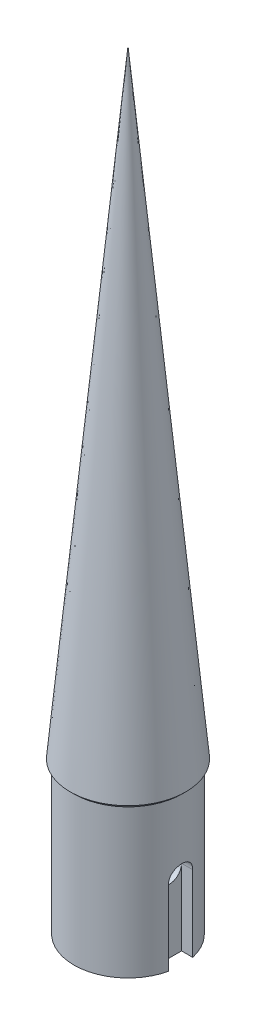
ISO-10303-21;
HEADER;
FILE_DESCRIPTION(('STEP AP214'),'2;1');
FILE_NAME('part.step','',(''),(''),'','','');
FILE_SCHEMA(('AUTOMOTIVE_DESIGN { 1 0 10303 214 1 1 1 1 }'));
ENDSEC;
DATA;
#1=APPLICATION_CONTEXT('core data for automotive mechanical design processes');
#2=APPLICATION_PROTOCOL_DEFINITION('international standard','automotive_design',2000,#1);
#3=PRODUCT_CONTEXT('',#1,'mechanical');
#4=PRODUCT('Part','Part','',(#3));
#5=PRODUCT_RELATED_PRODUCT_CATEGORY('part','',(#4));
#6=PRODUCT_DEFINITION_FORMATION('','',#4);
#7=PRODUCT_DEFINITION_CONTEXT('part definition',#1,'design');
#8=PRODUCT_DEFINITION('design','',#6,#7);
#9=PRODUCT_DEFINITION_SHAPE('','',#8);
#10=(LENGTH_UNIT() NAMED_UNIT(*) SI_UNIT(.MILLI.,.METRE.));
#11=(NAMED_UNIT(*) PLANE_ANGLE_UNIT() SI_UNIT($,.RADIAN.));
#12=(NAMED_UNIT(*) SI_UNIT($,.STERADIAN.) SOLID_ANGLE_UNIT());
#13=UNCERTAINTY_MEASURE_WITH_UNIT(LENGTH_MEASURE(1.E-05),#10,'distance_accuracy_value','');
#14=(GEOMETRIC_REPRESENTATION_CONTEXT(3) GLOBAL_UNCERTAINTY_ASSIGNED_CONTEXT((#13)) GLOBAL_UNIT_ASSIGNED_CONTEXT((#10,
#11,#12)) REPRESENTATION_CONTEXT('',''));
#15=CARTESIAN_POINT('',(0.,0.,0.));
#16=DIRECTION('',(0.,0.,1.));
#17=DIRECTION('',(1.,0.,0.));
#18=AXIS2_PLACEMENT_3D('',#15,#16,#17);
#19=CARTESIAN_POINT('',(0.,-25.,0.));
#20=DIRECTION('',(0.,1.,0.));
#21=DIRECTION('',(0.,0.,1.));
#22=AXIS2_PLACEMENT_3D('',#19,#20,#21);
#23=CYLINDRICAL_SURFACE('',#22,8.895);
#24=CARTESIAN_POINT('',(0.,-0.599999999999993,0.));
#25=DIRECTION('',(0.,1.,0.));
#26=DIRECTION('',(0.,0.,1.));
#27=AXIS2_PLACEMENT_3D('',#24,#25,#26);
#28=CIRCLE('',#27,8.895);
#29=CARTESIAN_POINT('',(0.,-0.599999999999993,8.895));
#30=VERTEX_POINT('',#29);
#31=EDGE_CURVE('E11',#30,#30,#28,.F.);
#32=ORIENTED_EDGE('',*,*,#31,.T.);
#33=EDGE_LOOP('',(#32));
#34=FACE_BOUND('',#33,.T.);
#35=DIRECTION('',(0.,-1.,0.));
#36=VECTOR('',#35,1.);
#37=CARTESIAN_POINT('',(-8.67082930632215,-12.5,-1.98437499999999));
#38=LINE('',#37,#36);
#39=CARTESIAN_POINT('',(-8.67082930632215,-12.5,-1.984375));
#40=VERTEX_POINT('',#39);
#41=CARTESIAN_POINT('',(-8.67082930632215,-25.,-1.98437499999999));
#42=VERTEX_POINT('',#41);
#43=EDGE_CURVE('E183',#40,#42,#38,.T.);
#44=ORIENTED_EDGE('',*,*,#43,.F.);
#45=CARTESIAN_POINT('',(-8.895,-10.515625,0.));
#46=CARTESIAN_POINT('',(-8.89499798053136,-10.5156286782961,-0.110003108531044));
#47=CARTESIAN_POINT('',(-8.89293872905295,-10.5248028437771,-0.220050190385659));
#48=CARTESIAN_POINT('',(-8.88492294410009,-10.5612168017032,-0.437014773196951));
#49=CARTESIAN_POINT('',(-8.87896370197709,-10.5884691501126,-0.543930045069365));
#50=CARTESIAN_POINT('',(-8.86381097564101,-10.66014046251,-0.751464389222808));
#51=CARTESIAN_POINT('',(-8.85462093856362,-10.7045411348459,-0.852090038043748));
#52=CARTESIAN_POINT('',(-8.83399673910637,-10.809189812261,-1.04446068714721));
#53=CARTESIAN_POINT('',(-8.82256261666939,-10.8694375352822,-1.13620584545178));
#54=CARTESIAN_POINT('',(-8.79848845487047,-11.0051316026497,-1.30974205494041));
#55=CARTESIAN_POINT('',(-8.78583296110134,-11.0807914141361,-1.39136405863448));
#56=CARTESIAN_POINT('',(-8.76085045969245,-11.2447038420026,-1.54087074401027));
#57=CARTESIAN_POINT('',(-8.74852348238285,-11.332957616368,-1.60875416107165));
#58=CARTESIAN_POINT('',(-8.72544092397066,-11.520810939859,-1.72960902031442));
#59=CARTESIAN_POINT('',(-8.71470512331446,-11.6205296910602,-1.78239929438126));
#60=CARTESIAN_POINT('',(-8.69624278881732,-11.8277023668504,-1.87040686218199));
#61=CARTESIAN_POINT('',(-8.68851587956583,-11.9351553244818,-1.90562634832583));
#62=CARTESIAN_POINT('',(-8.67710379688232,-12.1529089981679,-1.95693151039241));
#63=CARTESIAN_POINT('',(-8.67335534128796,-12.2631356576469,-1.9733171227466));
#64=CARTESIAN_POINT('',(-8.67013460913494,-12.4848322544565,-1.98742225140913));
#65=CARTESIAN_POINT('',(-8.67066178498573,-12.5963020307519,-1.98514415802333));
#66=CARTESIAN_POINT('',(-8.6758755128654,-12.8150819521088,-1.96222763913715));
#67=CARTESIAN_POINT('',(-8.68048286491296,-12.9224308899092,-1.94193880078754));
#68=CARTESIAN_POINT('',(-8.69321246305035,-13.1321618701326,-1.88413107223078));
#69=CARTESIAN_POINT('',(-8.70133491344556,-13.2345436234669,-1.84661118050843));
#70=CARTESIAN_POINT('',(-8.72025684575896,-13.4324107413625,-1.75508849250558));
#71=CARTESIAN_POINT('',(-8.73107785800529,-13.5278322502844,-1.70095228060515));
#72=CARTESIAN_POINT('',(-8.75416459631689,-13.7083654708171,-1.57782741855743));
#73=CARTESIAN_POINT('',(-8.76643052669428,-13.7934757209513,-1.50883666682662));
#74=CARTESIAN_POINT('',(-8.79136402902234,-13.9529819654673,-1.35611581093398));
#75=CARTESIAN_POINT('',(-8.8040344247618,-14.0270934621295,-1.27208872607875));
#76=CARTESIAN_POINT('',(-8.82809796612522,-14.1602203300518,-1.09265382918496));
#77=CARTESIAN_POINT('',(-8.83949108676558,-14.2192354060537,-0.99724579460952));
#78=CARTESIAN_POINT('',(-8.85975573704167,-14.3205689320845,-0.797402322384055));
#79=CARTESIAN_POINT('',(-8.86862144653922,-14.3628489299928,-0.692946759215006));
#80=CARTESIAN_POINT('',(-8.88278925247284,-14.4291766978656,-0.478171595830713));
#81=CARTESIAN_POINT('',(-8.88809188846723,-14.4532272283998,-0.367852886206666));
#82=CARTESIAN_POINT('',(-8.89445888054048,-14.4819968395156,-0.146922244637292));
#83=CARTESIAN_POINT('',(-8.89560839126927,-14.487104381303,-0.0363632839080309));
#84=CARTESIAN_POINT('',(-8.89377875578923,-14.4788975892449,0.184028216567811));
#85=CARTESIAN_POINT('',(-8.8907999015053,-14.4655845579548,0.293860807125686));
#86=CARTESIAN_POINT('',(-8.88110209755264,-14.4212364374193,0.508386435136476));
#87=CARTESIAN_POINT('',(-8.87442639805636,-14.3904061793644,0.613123945630332));
#88=CARTESIAN_POINT('',(-8.85808259752387,-14.3121269856043,0.815940337496674));
#89=CARTESIAN_POINT('',(-8.84841423460527,-14.2646765954544,0.914018635217614));
#90=CARTESIAN_POINT('',(-8.82694819211914,-14.1537022358176,1.10233086452755));
#91=CARTESIAN_POINT('',(-8.81512120261388,-14.0899514567944,1.1924277186746));
#92=CARTESIAN_POINT('',(-8.79070766484064,-13.9484834474263,1.36078396392382));
#93=CARTESIAN_POINT('',(-8.77812101382286,-13.8707643249358,1.43904174866253));
#94=CARTESIAN_POINT('',(-8.75331093693519,-13.7017800928848,1.58304298834678));
#95=CARTESIAN_POINT('',(-8.74109914583823,-13.6102832900571,1.64851693602485));
#96=CARTESIAN_POINT('',(-8.71869698047453,-13.4173649355546,1.76317168339184));
#97=CARTESIAN_POINT('',(-8.70850651768816,-13.315943818784,1.81235319663538));
#98=CARTESIAN_POINT('',(-8.69140054463049,-13.1066041991113,1.89268852324433));
#99=CARTESIAN_POINT('',(-8.68446640876592,-12.9987267288714,1.92394509722755));
#100=CARTESIAN_POINT('',(-8.67462629679212,-12.7790753551192,1.96784118701104));
#101=CARTESIAN_POINT('',(-8.67171964652347,-12.6673021069317,1.98048381861487));
#102=CARTESIAN_POINT('',(-8.67030729710035,-12.4457524437848,1.9866564116767));
#103=CARTESIAN_POINT('',(-8.67170310734381,-12.3359883589578,1.98061409297813));
#104=CARTESIAN_POINT('',(-8.67851500496339,-12.1190849742809,1.95054750257742));
#105=CARTESIAN_POINT('',(-8.68393104095299,-12.0119456408994,1.92652346071756));
#106=CARTESIAN_POINT('',(-8.6981241844418,-11.8036893505729,1.86138575645093));
#107=CARTESIAN_POINT('',(-8.70688857054173,-11.7025512531436,1.82033672721598));
#108=CARTESIAN_POINT('',(-8.72679539432478,-11.5085347915276,1.72236893705458));
#109=CARTESIAN_POINT('',(-8.73793809113817,-11.4156573289467,1.66544844663638));
#110=CARTESIAN_POINT('',(-8.76163848646004,-11.238695474782,1.53594515186167));
#111=CARTESIAN_POINT('',(-8.77422098481682,-11.154836679788,1.46305855847869));
#112=CARTESIAN_POINT('',(-8.79921922589108,-11.0004001651611,1.30430465490752));
#113=CARTESIAN_POINT('',(-8.81163492929224,-10.9298255275292,1.21843434073407));
#114=CARTESIAN_POINT('',(-8.83510136371243,-10.8030382120514,1.03474108869537));
#115=CARTESIAN_POINT('',(-8.84613120897754,-10.7470341562857,0.936771332481138));
#116=CARTESIAN_POINT('',(-8.86537241774909,-10.6523773860926,0.732581640881906));
#117=CARTESIAN_POINT('',(-8.87358609932992,-10.6137103928671,0.626368579579056));
#118=CARTESIAN_POINT('',(-8.88483654653533,-10.5615673365609,0.43340420838887));
#119=CARTESIAN_POINT('',(-8.88862390497389,-10.5443723842688,0.347682052709739));
#120=CARTESIAN_POINT('',(-8.8937063738634,-10.5214000285145,0.174649120553264));
#121=CARTESIAN_POINT('',(-8.89500160338379,-10.5156220795683,0.0873384201749424));
#122=CARTESIAN_POINT('',(-8.895,-10.515625,0.));
#123=B_SPLINE_CURVE_WITH_KNOTS('',3,(#45,#46,#47,#48,#49,#50,#51,#52,#53,#54,#55,#56,#57,#58,
#59,#60,#61,#62,#63,#64,#65,#66,#67,#68,#69,#70,#71,#72,#73,#74,#75,#76,#77,#78,#79,#80,#81,#82,
#83,#84,#85,#86,#87,#88,#89,#90,#91,#92,#93,#94,#95,#96,#97,#98,#99,#100,#101,#102,#103,#104,
#105,#106,#107,#108,#109,#110,#111,#112,#113,#114,#115,#116,#117,#118,#119,#120,#121,#122),
.UNSPECIFIED.,.T.,.F.,(4,2,2,2,2,2,2,2,2,2,2,2,2,2,2,2,2,2,2,2,2,2,2,2,2,2,2,2,2,2,2,2,2,2,2,2,
2,2,4),(0.,0.32968958471569,0.659608391077071,0.989176249620352,1.31873824265806,
1.65322013476703,1.98773280154188,2.32610663322488,2.6644382334597,2.99730368340978,
3.33012650314447,3.65662716066737,3.98314679768962,4.31235992028412,4.64161964977686,
4.97829541698964,5.31497776845579,5.65242928429447,5.98982968812842,6.32027155964406,
6.65069006614927,6.9773221968005,7.30398291850589,7.63546294699817,7.96698791151875,
8.30488633992517,8.64276996754305,8.97869668766252,9.31456717032856,9.64280656540119,
9.97104176499135,10.2980421054524,10.6250780926347,10.9589814011184,11.2929620818613,
11.631489944489,11.9697384812382,12.2315123866697,12.493273784704),.UNSPECIFIED.);
#124=CARTESIAN_POINT('',(-8.67082930632215,-12.5,1.984375));
#125=VERTEX_POINT('',#124);
#126=EDGE_CURVE('E145',#125,#40,#123,.T.);
#127=ORIENTED_EDGE('',*,*,#126,.F.);
#128=DIRECTION('',(0.,-1.,0.));
#129=VECTOR('',#128,1.);
#130=CARTESIAN_POINT('',(-8.67082930632215,-12.5,1.984375));
#131=LINE('',#130,#129);
#132=CARTESIAN_POINT('',(-8.67082930632215,-25.,1.984375));
#133=VERTEX_POINT('',#132);
#134=EDGE_CURVE('E186',#125,#133,#131,.T.);
#135=ORIENTED_EDGE('',*,*,#134,.T.);
#136=CARTESIAN_POINT('',(0.,-25.,0.));
#137=DIRECTION('',(0.,1.,0.));
#138=DIRECTION('',(0.,0.,1.));
#139=AXIS2_PLACEMENT_3D('',#136,#137,#138);
#140=CIRCLE('',#139,8.895);
#141=CARTESIAN_POINT('',(8.67082930632215,-25.,1.984375));
#142=VERTEX_POINT('',#141);
#143=EDGE_CURVE('E192',#133,#142,#140,.T.);
#144=ORIENTED_EDGE('',*,*,#143,.T.);
#145=DIRECTION('',(0.,-1.,0.));
#146=VECTOR('',#145,1.);
#147=CARTESIAN_POINT('',(8.67082930632215,-12.5,1.984375));
#148=LINE('',#147,#146);
#149=CARTESIAN_POINT('',(8.67082930632215,-12.5,1.984375));
#150=VERTEX_POINT('',#149);
#151=EDGE_CURVE('E57',#150,#142,#148,.T.);
#152=ORIENTED_EDGE('',*,*,#151,.F.);
#153=CARTESIAN_POINT('',(8.67082930632215,-12.5,-1.984375));
#154=CARTESIAN_POINT('',(8.67083152693427,-12.3900352924012,-1.98437129476868));
#155=CARTESIAN_POINT('',(8.67294398159313,-12.2800265459929,-1.97520331559507));
#156=CARTESIAN_POINT('',(8.68114924080244,-12.0631415333078,-1.9388161542682));
#157=CARTESIAN_POINT('',(8.687244848201,-11.956267528248,-1.91158426077147));
#158=CARTESIAN_POINT('',(8.70269247518692,-11.748820633369,-1.83997273746253));
#159=CARTESIAN_POINT('',(8.71204083806803,-11.6482408168817,-1.79561235715901));
#160=CARTESIAN_POINT('',(8.73293623267991,-11.4559475998378,-1.69105869172377));
#161=CARTESIAN_POINT('',(8.74448323779282,-11.3642340919615,-1.63086559826731));
#162=CARTESIAN_POINT('',(8.76870152698746,-11.190664815864,-1.49522783567887));
#163=CARTESIAN_POINT('',(8.78138768085908,-11.1089875068265,-1.41955741552215));
#164=CARTESIAN_POINT('',(8.80632483899608,-10.959373320034,-1.25560020996667));
#165=CARTESIAN_POINT('',(8.81857580851969,-10.8914375372732,-1.16731242010812));
#166=CARTESIAN_POINT('',(8.8414245341093,-10.7705257147047,-0.979426653986215));
#167=CARTESIAN_POINT('',(8.85200269761223,-10.7177218091067,-0.879715314874414));
#168=CARTESIAN_POINT('',(8.87014575131516,-10.6296870280497,-0.672558617309702));
#169=CARTESIAN_POINT('',(8.8777109934971,-10.5944540997552,-0.56511416400382));
#170=CARTESIAN_POINT('',(8.88887072235122,-10.5431240620808,-0.347397468059264));
#171=CARTESIAN_POINT('',(8.89252784470798,-10.5267247747917,-0.237199733411299));
#172=CARTESIAN_POINT('',(8.89567645545256,-10.5125822573189,-0.0155605825450066));
#173=CARTESIAN_POINT('',(8.89516843879117,-10.5148368104668,0.0958806843305372));
#174=CARTESIAN_POINT('',(8.89009171695082,-10.5377139363359,0.31475870560092));
#175=CARTESIAN_POINT('',(8.88559503342556,-10.5580107416537,0.422231426260748));
#176=CARTESIAN_POINT('',(8.8731285194068,-10.6158765069307,0.63220575827785));
#177=CARTESIAN_POINT('',(8.86515852778899,-10.6534462681744,0.734707138772998));
#178=CARTESIAN_POINT('',(8.84652583210922,-10.7450763392216,0.932727372605715));
#179=CARTESIAN_POINT('',(8.83584323372576,-10.7992591265551,1.02818760316908));
#180=CARTESIAN_POINT('',(8.81295504188348,-10.9224856773742,1.2087789663073));
#181=CARTESIAN_POINT('',(8.80074923327929,-10.9915315411911,1.29390863638836));
#182=CARTESIAN_POINT('',(8.77584357058241,-11.1442943709138,1.45336071135604));
#183=CARTESIAN_POINT('',(8.76313874101006,-11.2282964215203,1.5274094616731));
#184=CARTESIAN_POINT('',(8.73891357366072,-11.4076579397835,1.66042127107666));
#185=CARTESIAN_POINT('',(8.72739327066983,-11.5030177408069,1.71938388720298));
#186=CARTESIAN_POINT('',(8.70682769295961,-11.7028425850512,1.82067818880462));
#187=CARTESIAN_POINT('',(8.69779041740815,-11.8073356589106,1.86295631105176));
#188=CARTESIAN_POINT('',(8.68332365321309,-12.022193123648,1.92926911648296));
#189=CARTESIAN_POINT('',(8.67789356668125,-12.1325565382453,1.95330682309304));
#190=CARTESIAN_POINT('',(8.67137842965835,-12.3535164219845,1.98202813124953));
#191=CARTESIAN_POINT('',(8.6702037566994,-12.4640584104577,1.98711100551234));
#192=CARTESIAN_POINT('',(8.67209039478514,-12.6844102825169,1.97886095731595));
#193=CARTESIAN_POINT('',(8.67515140212929,-12.7942202180243,1.96552935518464));
#194=CARTESIAN_POINT('',(8.68507970183092,-13.008588609668,1.92117571919051));
#195=CARTESIAN_POINT('',(8.69189929584423,-13.1131953191398,1.8903752346446));
#196=CARTESIAN_POINT('',(8.70853304572482,-13.3157631209793,1.81219878075513));
#197=CARTESIAN_POINT('',(8.71834749764175,-13.4137235551742,1.76482117265091));
#198=CARTESIAN_POINT('',(8.74006093984554,-13.6019411777236,1.65396154223488));
#199=CARTESIAN_POINT('',(8.75199070504297,-13.6920504352035,1.59023451518154));
#200=CARTESIAN_POINT('',(8.7765101984565,-13.8604425592094,1.4488041612309));
#201=CARTESIAN_POINT('',(8.78910001194908,-13.9387238925018,1.37109902523044));
#202=CARTESIAN_POINT('',(8.81381758079177,-14.0827966953209,1.20210799703321));
#203=CARTESIAN_POINT('',(8.82593157346983,-14.14831541272,1.11058721230565));
#204=CARTESIAN_POINT('',(8.84807556919855,-14.2630486894093,0.91760694147292));
#205=CARTESIAN_POINT('',(8.85810567158719,-14.3122640259399,0.816147929457443));
#206=CARTESIAN_POINT('',(8.87489393112164,-14.3926180815481,0.606815775294063));
#207=CARTESIAN_POINT('',(8.88167322724541,-14.423873857297,0.498989339167028));
#208=CARTESIAN_POINT('',(8.89128759699143,-14.4677855598397,0.279447263775833));
#209=CARTESIAN_POINT('',(8.89412326837703,-14.4804443055345,0.167732216568148));
#210=CARTESIAN_POINT('',(8.89551225388667,-14.4866716096712,-0.0538303410463871));
#211=CARTESIAN_POINT('',(8.89415677257247,-14.4806467378316,-0.1636660480899));
#212=CARTESIAN_POINT('',(8.88751206547856,-14.4505901194767,-0.380717396055891));
#213=CARTESIAN_POINT('',(8.88222291602629,-14.4265587223531,-0.487933087774485));
#214=CARTESIAN_POINT('',(8.86831291596493,-14.3613693329617,-0.696371660604404));
#215=CARTESIAN_POINT('',(8.85970370424092,-14.3202711322204,-0.797614067913526));
#216=CARTESIAN_POINT('',(8.84007111469181,-14.2221722616271,-0.991819184416284));
#217=CARTESIAN_POINT('',(8.82904749249992,-14.1651699819348,-1.08478105418124));
#218=CARTESIAN_POINT('',(8.80551621508588,-14.0355666300762,-1.26176241652204));
#219=CARTESIAN_POINT('',(8.79298364506869,-13.9626809241806,-1.34557017665365));
#220=CARTESIAN_POINT('',(8.76797805507896,-13.8039510336438,-1.49990415519922));
#221=CARTESIAN_POINT('',(8.7555050502752,-13.7181037126502,-1.57042714975871));
#222=CARTESIAN_POINT('',(8.73183513193552,-13.5344380779377,-1.69714603015807));
#223=CARTESIAN_POINT('',(8.72065858524308,-13.4364686619124,-1.75312694377475));
#224=CARTESIAN_POINT('',(8.7011051990314,-13.2322823615859,-1.84774053682795));
#225=CARTESIAN_POINT('',(8.69272603418347,-13.126072418212,-1.88638763425605));
#226=CARTESIAN_POINT('',(8.68123438698859,-12.9331580464439,-1.93848519859973));
#227=CARTESIAN_POINT('',(8.67735881646133,-12.847485490319,-1.95566030472962));
#228=CARTESIAN_POINT('',(8.67215546197685,-12.6745511498479,-1.97860637521381));
#229=CARTESIAN_POINT('',(8.67082754361105,-12.5872894495867,-1.98437794119458));
#230=CARTESIAN_POINT('',(8.67082930632215,-12.5,-1.984375));
#231=B_SPLINE_CURVE_WITH_KNOTS('',3,(#153,#154,#155,#156,#157,#158,#159,#160,#161,#162,#163,
#164,#165,#166,#167,#168,#169,#170,#171,#172,#173,#174,#175,#176,#177,#178,#179,#180,#181,#182,
#183,#184,#185,#186,#187,#188,#189,#190,#191,#192,#193,#194,#195,#196,#197,#198,#199,#200,#201,
#202,#203,#204,#205,#206,#207,#208,#209,#210,#211,#212,#213,#214,#215,#216,#217,#218,#219,#220,
#221,#222,#223,#224,#225,#226,#227,#228,#229,#230),.UNSPECIFIED.,.T.,.F.,(4,2,2,2,2,2,2,2,2,2,2,
2,2,2,2,2,2,2,2,2,2,2,2,2,2,2,2,2,2,2,2,2,2,2,2,2,2,2,4),(0.,0.329574133527324,
0.659380430494616,0.988817154975628,1.31824989138673,1.6528827972829,1.98754235792109,
2.32587008991828,2.66415828546683,2.99693943397993,3.32968103809655,3.65653406946799,
3.98340226493483,4.31274068542326,4.6421256759768,4.97863673959058,5.31515768273329,
5.65275035769749,5.99028706301795,6.32067223910689,6.65103372763026,6.97729620213301,
7.30359093900236,7.63509437723089,7.96664075087856,8.30464018838773,8.64262350993627,
8.97837818149084,9.31408195476448,9.64253221398148,9.97097610023751,10.2982789020109,
10.6256148460068,10.9593860612475,11.2932381697132,11.6317758832356,11.9700314818907,
12.2316596280387,12.4932739708748),.UNSPECIFIED.);
#232=CARTESIAN_POINT('',(8.67082930632215,-12.5,-1.984375));
#233=VERTEX_POINT('',#232);
#234=EDGE_CURVE('E123',#233,#150,#231,.T.);
#235=ORIENTED_EDGE('',*,*,#234,.F.);
#236=DIRECTION('',(0.,-1.,0.));
#237=VECTOR('',#236,1.);
#238=CARTESIAN_POINT('',(8.67082930632215,-12.5,-1.98437499999999));
#239=LINE('',#238,#237);
#240=CARTESIAN_POINT('',(8.67082930632215,-25.,-1.98437499999999));
#241=VERTEX_POINT('',#240);
#242=EDGE_CURVE('E157',#233,#241,#239,.T.);
#243=ORIENTED_EDGE('',*,*,#242,.T.);
#244=EDGE_CURVE('E185',#241,#42,#140,.T.);
#245=ORIENTED_EDGE('',*,*,#244,.T.);
#246=EDGE_LOOP('',(#44,#127,#135,#144,#152,#235,#243,#245));
#247=FACE_BOUND('',#246,.T.);
#248=ADVANCED_FACE('F41',(#34,#247),#23,.T.);
#249=CARTESIAN_POINT('',(0.,-25.,0.));
#250=DIRECTION('',(0.,1.,0.));
#251=DIRECTION('',(0.,0.,1.));
#252=AXIS2_PLACEMENT_3D('',#249,#250,#251);
#253=PLANE('',#252);
#254=DIRECTION('',(-1.,0.,0.));
#255=VECTOR('',#254,1.);
#256=CARTESIAN_POINT('',(6.83125,-25.,-1.984375));
#257=LINE('',#256,#255);
#258=CARTESIAN_POINT('',(6.83125,-25.,-1.984375));
#259=VERTEX_POINT('',#258);
#260=EDGE_CURVE('E150',#241,#259,#257,.T.);
#261=ORIENTED_EDGE('',*,*,#260,.T.);
#262=DIRECTION('',(0.,0.,1.));
#263=VECTOR('',#262,1.);
#264=CARTESIAN_POINT('',(6.83125,-25.,1.984375));
#265=LINE('',#264,#263);
#266=CARTESIAN_POINT('',(6.83125,-25.,1.984375));
#267=VERTEX_POINT('',#266);
#268=EDGE_CURVE('E155',#259,#267,#265,.T.);
#269=ORIENTED_EDGE('',*,*,#268,.T.);
#270=DIRECTION('',(1.,0.,0.));
#271=VECTOR('',#270,1.);
#272=CARTESIAN_POINT('',(6.83125,-25.,1.984375));
#273=LINE('',#272,#271);
#274=EDGE_CURVE('E160',#267,#142,#273,.T.);
#275=ORIENTED_EDGE('',*,*,#274,.T.);
#276=ORIENTED_EDGE('',*,*,#143,.F.);
#277=DIRECTION('',(-1.,0.,0.));
#278=VECTOR('',#277,1.);
#279=CARTESIAN_POINT('',(-6.83125,-25.,1.984375));
#280=LINE('',#279,#278);
#281=CARTESIAN_POINT('',(-6.83125,-25.,1.984375));
#282=VERTEX_POINT('',#281);
#283=EDGE_CURVE('E175',#282,#133,#280,.T.);
#284=ORIENTED_EDGE('',*,*,#283,.F.);
#285=DIRECTION('',(0.,0.,1.));
#286=VECTOR('',#285,1.);
#287=CARTESIAN_POINT('',(-6.83125,-25.,1.984375));
#288=LINE('',#287,#286);
#289=CARTESIAN_POINT('',(-6.83125,-25.,-1.984375));
#290=VERTEX_POINT('',#289);
#291=EDGE_CURVE('E179',#290,#282,#288,.T.);
#292=ORIENTED_EDGE('',*,*,#291,.F.);
#293=DIRECTION('',(1.,0.,0.));
#294=VECTOR('',#293,1.);
#295=CARTESIAN_POINT('',(-6.83125,-25.,-1.984375));
#296=LINE('',#295,#294);
#297=EDGE_CURVE('E65',#42,#290,#296,.T.);
#298=ORIENTED_EDGE('',*,*,#297,.F.);
#299=ORIENTED_EDGE('',*,*,#244,.F.);
#300=EDGE_LOOP('',(#261,#269,#275,#276,#284,#292,#298,#299));
#301=FACE_BOUND('',#300,.T.);
#302=ADVANCED_FACE('F205',(#301),#253,.F.);
#303=CARTESIAN_POINT('',(-6.83125,-12.5,-1.984375));
#304=DIRECTION('',(0.,0.,-1.));
#305=DIRECTION('',(-1.,0.,0.));
#306=AXIS2_PLACEMENT_3D('',#303,#304,#305);
#307=PLANE('',#306);
#308=ORIENTED_EDGE('',*,*,#297,.T.);
#309=DIRECTION('',(0.,-1.,0.));
#310=VECTOR('',#309,1.);
#311=CARTESIAN_POINT('',(-6.83125,-12.5,-1.984375));
#312=LINE('',#311,#310);
#313=CARTESIAN_POINT('',(-6.83125,-12.5,-1.984375));
#314=VERTEX_POINT('',#313);
#315=EDGE_CURVE('E177',#314,#290,#312,.T.);
#316=ORIENTED_EDGE('',*,*,#315,.F.);
#317=DIRECTION('',(1.,0.,0.));
#318=VECTOR('',#317,1.);
#319=CARTESIAN_POINT('',(-6.83125,-12.5,-1.984375));
#320=LINE('',#319,#318);
#321=EDGE_CURVE('E172',#40,#314,#320,.T.);
#322=ORIENTED_EDGE('',*,*,#321,.F.);
#323=ORIENTED_EDGE('',*,*,#43,.T.);
#324=EDGE_LOOP('',(#308,#316,#322,#323));
#325=FACE_BOUND('',#324,.T.);
#326=ADVANCED_FACE('F210',(#325),#307,.F.);
#327=CARTESIAN_POINT('',(-6.83125,-12.5,1.984375));
#328=DIRECTION('',(0.,0.,1.));
#329=DIRECTION('',(1.,0.,0.));
#330=AXIS2_PLACEMENT_3D('',#327,#328,#329);
#331=PLANE('',#330);
#332=ORIENTED_EDGE('',*,*,#283,.T.);
#333=ORIENTED_EDGE('',*,*,#134,.F.);
#334=DIRECTION('',(-1.,0.,0.));
#335=VECTOR('',#334,1.);
#336=CARTESIAN_POINT('',(-6.83125,-12.5,1.984375));
#337=LINE('',#336,#335);
#338=CARTESIAN_POINT('',(-6.83125,-12.5,1.984375));
#339=VERTEX_POINT('',#338);
#340=EDGE_CURVE('E174',#339,#125,#337,.T.);
#341=ORIENTED_EDGE('',*,*,#340,.F.);
#342=DIRECTION('',(0.,-1.,0.));
#343=VECTOR('',#342,1.);
#344=CARTESIAN_POINT('',(-6.83125,-12.5,1.984375));
#345=LINE('',#344,#343);
#346=EDGE_CURVE('E189',#339,#282,#345,.T.);
#347=ORIENTED_EDGE('',*,*,#346,.T.);
#348=EDGE_LOOP('',(#332,#333,#341,#347));
#349=FACE_BOUND('',#348,.T.);
#350=ADVANCED_FACE('F228',(#349),#331,.F.);
#351=CARTESIAN_POINT('',(-6.83125,-12.5,1.984375));
#352=DIRECTION('',(1.,0.,0.));
#353=DIRECTION('',(0.,0.,-1.));
#354=AXIS2_PLACEMENT_3D('',#351,#352,#353);
#355=PLANE('',#354);
#356=ORIENTED_EDGE('',*,*,#346,.F.);
#357=CARTESIAN_POINT('',(-6.83125,-12.5,0.));
#358=DIRECTION('',(1.,0.,0.));
#359=DIRECTION('',(0.,0.,-1.));
#360=AXIS2_PLACEMENT_3D('',#357,#358,#359);
#361=CIRCLE('',#360,1.984375);
#362=EDGE_CURVE('E131',#339,#314,#361,.T.);
#363=ORIENTED_EDGE('',*,*,#362,.T.);
#364=ORIENTED_EDGE('',*,*,#315,.T.);
#365=ORIENTED_EDGE('',*,*,#291,.T.);
#366=EDGE_LOOP('',(#356,#363,#364,#365));
#367=FACE_BOUND('',#366,.T.);
#368=ADVANCED_FACE('F223',(#367),#355,.F.);
#369=CARTESIAN_POINT('',(6.83125,-12.5,-1.984375));
#370=DIRECTION('',(0.,0.,1.));
#371=DIRECTION('',(1.,0.,0.));
#372=AXIS2_PLACEMENT_3D('',#369,#370,#371);
#373=PLANE('',#372);
#374=ORIENTED_EDGE('',*,*,#260,.F.);
#375=ORIENTED_EDGE('',*,*,#242,.F.);
#376=DIRECTION('',(-1.,0.,0.));
#377=VECTOR('',#376,1.);
#378=CARTESIAN_POINT('',(6.83125,-12.5,-1.984375));
#379=LINE('',#378,#377);
#380=CARTESIAN_POINT('',(6.83125,-12.5,-1.984375));
#381=VERTEX_POINT('',#380);
#382=EDGE_CURVE('E151',#233,#381,#379,.T.);
#383=ORIENTED_EDGE('',*,*,#382,.T.);
#384=DIRECTION('',(0.,-1.,0.));
#385=VECTOR('',#384,1.);
#386=CARTESIAN_POINT('',(6.83125,-12.5,-1.984375));
#387=LINE('',#386,#385);
#388=EDGE_CURVE('E164',#381,#259,#387,.T.);
#389=ORIENTED_EDGE('',*,*,#388,.T.);
#390=EDGE_LOOP('',(#374,#375,#383,#389));
#391=FACE_BOUND('',#390,.T.);
#392=ADVANCED_FACE('F236',(#391),#373,.T.);
#393=CARTESIAN_POINT('',(6.83125,-12.5,1.984375));
#394=DIRECTION('',(1.,0.,0.));
#395=DIRECTION('',(0.,0.,-1.));
#396=AXIS2_PLACEMENT_3D('',#393,#394,#395);
#397=PLANE('',#396);
#398=CARTESIAN_POINT('',(6.83125,-12.5,0.));
#399=DIRECTION('',(1.,0.,0.));
#400=DIRECTION('',(0.,0.,-1.));
#401=AXIS2_PLACEMENT_3D('',#398,#399,#400);
#402=CIRCLE('',#401,1.984375);
#403=CARTESIAN_POINT('',(6.83125,-12.5,1.984375));
#404=VERTEX_POINT('',#403);
#405=EDGE_CURVE('E121',#404,#381,#402,.T.);
#406=ORIENTED_EDGE('',*,*,#405,.F.);
#407=DIRECTION('',(0.,-1.,0.));
#408=VECTOR('',#407,1.);
#409=CARTESIAN_POINT('',(6.83125,-12.5,1.984375));
#410=LINE('',#409,#408);
#411=EDGE_CURVE('E167',#404,#267,#410,.T.);
#412=ORIENTED_EDGE('',*,*,#411,.T.);
#413=ORIENTED_EDGE('',*,*,#268,.F.);
#414=ORIENTED_EDGE('',*,*,#388,.F.);
#415=EDGE_LOOP('',(#406,#412,#413,#414));
#416=FACE_BOUND('',#415,.T.);
#417=ADVANCED_FACE('F142',(#416),#397,.T.);
#418=CARTESIAN_POINT('',(6.83125,-12.5,1.984375));
#419=DIRECTION('',(0.,0.,-1.));
#420=DIRECTION('',(-1.,0.,0.));
#421=AXIS2_PLACEMENT_3D('',#418,#419,#420);
#422=PLANE('',#421);
#423=ORIENTED_EDGE('',*,*,#274,.F.);
#424=ORIENTED_EDGE('',*,*,#411,.F.);
#425=DIRECTION('',(1.,0.,0.));
#426=VECTOR('',#425,1.);
#427=CARTESIAN_POINT('',(6.83125,-12.5,1.984375));
#428=LINE('',#427,#426);
#429=EDGE_CURVE('E154',#404,#150,#428,.T.);
#430=ORIENTED_EDGE('',*,*,#429,.T.);
#431=ORIENTED_EDGE('',*,*,#151,.T.);
#432=EDGE_LOOP('',(#423,#424,#430,#431));
#433=FACE_BOUND('',#432,.T.);
#434=ADVANCED_FACE('F140',(#433),#422,.T.);
#435=CARTESIAN_POINT('',(-8.895,-12.5,0.));
#436=DIRECTION('',(1.,0.,0.));
#437=DIRECTION('',(0.,0.,-1.));
#438=AXIS2_PLACEMENT_3D('',#435,#436,#437);
#439=CYLINDRICAL_SURFACE('',#438,1.984375);
#440=ORIENTED_EDGE('',*,*,#126,.T.);
#441=ORIENTED_EDGE('',*,*,#321,.T.);
#442=ORIENTED_EDGE('',*,*,#362,.F.);
#443=ORIENTED_EDGE('',*,*,#340,.T.);
#444=EDGE_LOOP('',(#440,#441,#442,#443));
#445=FACE_BOUND('',#444,.T.);
#446=ORIENTED_EDGE('',*,*,#234,.T.);
#447=ORIENTED_EDGE('',*,*,#429,.F.);
#448=ORIENTED_EDGE('',*,*,#405,.T.);
#449=ORIENTED_EDGE('',*,*,#382,.F.);
#450=EDGE_LOOP('',(#446,#447,#448,#449));
#451=FACE_BOUND('',#450,.T.);
#452=ADVANCED_FACE('F135',(#445,#451),#439,.F.);
#453=CARTESIAN_POINT('',(0.,0.,0.));
#454=DIRECTION('',(0.,1.,0.));
#455=DIRECTION('',(-1.,0.,0.));
#456=AXIS2_PLACEMENT_3D('',#453,#454,#455);
#457=PLANE('',#456);
#458=CARTESIAN_POINT('',(0.,0.,0.));
#459=DIRECTION('',(0.,1.,0.));
#460=DIRECTION('',(-1.,0.,0.));
#461=AXIS2_PLACEMENT_3D('',#458,#459,#460);
#462=CIRCLE('',#461,9.495);
#463=CARTESIAN_POINT('',(-9.495,0.,0.));
#464=VERTEX_POINT('',#463);
#465=EDGE_CURVE('E50',#464,#464,#462,.T.);
#466=ORIENTED_EDGE('',*,*,#465,.T.);
#467=EDGE_LOOP('',(#466));
#468=FACE_BOUND('',#467,.T.);
#469=CARTESIAN_POINT('',(0.,0.,0.));
#470=DIRECTION('',(0.,1.,0.));
#471=DIRECTION('',(-1.,0.,0.));
#472=AXIS2_PLACEMENT_3D('',#469,#470,#471);
#473=CIRCLE('',#472,9.5);
#474=CARTESIAN_POINT('',(-9.5,0.,0.));
#475=VERTEX_POINT('',#474);
#476=EDGE_CURVE('E119',#475,#475,#473,.T.);
#477=ORIENTED_EDGE('',*,*,#476,.F.);
#478=EDGE_LOOP('',(#477));
#479=FACE_BOUND('',#478,.T.);
#480=ADVANCED_FACE('F115',(#468,#479),#457,.F.);
#481=CARTESIAN_POINT('',(0.,0.,0.));
#482=DIRECTION('',(0.,-1.,0.));
#483=DIRECTION('',(1.,0.,0.));
#484=AXIS2_PLACEMENT_3D('',#481,#482,#483);
#485=CONICAL_SURFACE('',#484,9.5,0.0932328564142124);
#486=CARTESIAN_POINT('',(0.,101.6,0.));
#487=VERTEX_POINT('',#486);
#488=VERTEX_LOOP('',#487);
#489=FACE_BOUND('',#488,.T.);
#490=ORIENTED_EDGE('',*,*,#476,.T.);
#491=EDGE_LOOP('',(#490));
#492=FACE_BOUND('',#491,.T.);
#493=ADVANCED_FACE('F112',(#489,#492),#485,.T.);
#494=CARTESIAN_POINT('',(0.,0.,0.));
#495=DIRECTION('',(0.,1.,0.));
#496=DIRECTION('',(0.,0.,1.));
#497=AXIS2_PLACEMENT_3D('',#494,#495,#496);
#498=CONICAL_SURFACE('',#497,9.495,0.785398163397451);
#499=ORIENTED_EDGE('',*,*,#31,.F.);
#500=EDGE_LOOP('',(#499));
#501=FACE_BOUND('',#500,.T.);
#502=ORIENTED_EDGE('',*,*,#465,.F.);
#503=EDGE_LOOP('',(#502));
#504=FACE_BOUND('',#503,.T.);
#505=ADVANCED_FACE('F44',(#501,#504),#498,.T.);
#506=CLOSED_SHELL('',(#248,#302,#326,#350,#368,#392,#417,#434,#452,#480,#493,#505));
#507=MANIFOLD_SOLID_BREP('B2',#506);
#508=ADVANCED_BREP_SHAPE_REPRESENTATION('',(#18,#507),#14);
#509=SHAPE_DEFINITION_REPRESENTATION(#9,#508);
ENDSEC;
END-ISO-10303-21;
